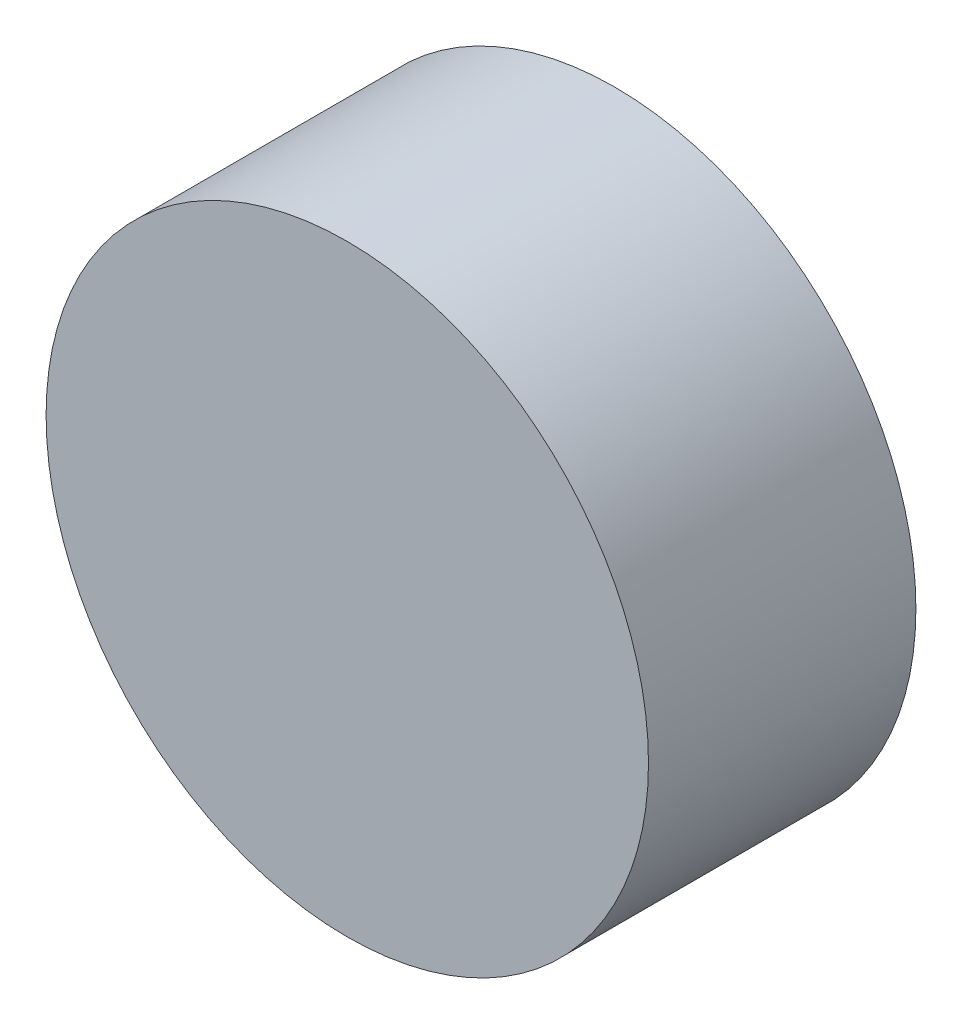
ISO-10303-21;
HEADER;
FILE_DESCRIPTION(('STEP AP214'),'2;1');
FILE_NAME('part.step','',(''),(''),'','','');
FILE_SCHEMA(('AUTOMOTIVE_DESIGN { 1 0 10303 214 1 1 1 1 }'));
ENDSEC;
DATA;
#1=APPLICATION_CONTEXT('core data for automotive mechanical design processes');
#2=APPLICATION_PROTOCOL_DEFINITION('international standard','automotive_design',2000,#1);
#3=PRODUCT_CONTEXT('',#1,'mechanical');
#4=PRODUCT('Part','Part','',(#3));
#5=PRODUCT_RELATED_PRODUCT_CATEGORY('part','',(#4));
#6=PRODUCT_DEFINITION_FORMATION('','',#4);
#7=PRODUCT_DEFINITION_CONTEXT('part definition',#1,'design');
#8=PRODUCT_DEFINITION('design','',#6,#7);
#9=PRODUCT_DEFINITION_SHAPE('','',#8);
#10=(LENGTH_UNIT() NAMED_UNIT(*) SI_UNIT(.MILLI.,.METRE.));
#11=(NAMED_UNIT(*) PLANE_ANGLE_UNIT() SI_UNIT($,.RADIAN.));
#12=(NAMED_UNIT(*) SI_UNIT($,.STERADIAN.) SOLID_ANGLE_UNIT());
#13=UNCERTAINTY_MEASURE_WITH_UNIT(LENGTH_MEASURE(1.E-05),#10,'distance_accuracy_value','');
#14=(GEOMETRIC_REPRESENTATION_CONTEXT(3) GLOBAL_UNCERTAINTY_ASSIGNED_CONTEXT((#13)) GLOBAL_UNIT_ASSIGNED_CONTEXT((#10,
#11,#12)) REPRESENTATION_CONTEXT('',''));
#15=CARTESIAN_POINT('',(0.,0.,0.));
#16=DIRECTION('',(0.,0.,1.));
#17=DIRECTION('',(1.,0.,0.));
#18=AXIS2_PLACEMENT_3D('',#15,#16,#17);
#19=CARTESIAN_POINT('',(0.,0.,11.4));
#20=DIRECTION('',(0.,0.,-1.));
#21=DIRECTION('',(-1.,0.,0.));
#22=AXIS2_PLACEMENT_3D('',#19,#20,#21);
#23=CYLINDRICAL_SURFACE('',#22,12.8396999999119);
#24=CARTESIAN_POINT('',(0.,0.,11.4));
#25=DIRECTION('',(0.,0.,1.));
#26=DIRECTION('',(1.,0.,0.));
#27=AXIS2_PLACEMENT_3D('',#24,#25,#26);
#28=CIRCLE('',#27,12.8396999999119);
#29=CARTESIAN_POINT('',(12.8396999999119,0.,11.4));
#30=VERTEX_POINT('',#29);
#31=EDGE_CURVE('E10',#30,#30,#28,.T.);
#32=ORIENTED_EDGE('',*,*,#31,.F.);
#33=EDGE_LOOP('',(#32));
#34=FACE_BOUND('',#33,.T.);
#35=CARTESIAN_POINT('',(0.,0.,0.));
#36=DIRECTION('',(0.,0.,1.));
#37=DIRECTION('',(1.,0.,0.));
#38=AXIS2_PLACEMENT_3D('',#35,#36,#37);
#39=CIRCLE('',#38,12.8396999999119);
#40=CARTESIAN_POINT('',(12.8396999999119,0.,0.));
#41=VERTEX_POINT('',#40);
#42=EDGE_CURVE('E36',#41,#41,#39,.T.);
#43=ORIENTED_EDGE('',*,*,#42,.T.);
#44=EDGE_LOOP('',(#43));
#45=FACE_BOUND('',#44,.T.);
#46=ADVANCED_FACE('F33',(#34,#45),#23,.T.);
#47=CARTESIAN_POINT('',(0.,0.,11.4));
#48=DIRECTION('',(0.,0.,1.));
#49=DIRECTION('',(1.,0.,0.));
#50=AXIS2_PLACEMENT_3D('',#47,#48,#49);
#51=PLANE('',#50);
#52=ORIENTED_EDGE('',*,*,#31,.T.);
#53=EDGE_LOOP('',(#52));
#54=FACE_BOUND('',#53,.T.);
#55=ADVANCED_FACE('F48',(#54),#51,.T.);
#56=CARTESIAN_POINT('',(0.,0.,0.));
#57=DIRECTION('',(0.,0.,1.));
#58=DIRECTION('',(1.,0.,0.));
#59=AXIS2_PLACEMENT_3D('',#56,#57,#58);
#60=PLANE('',#59);
#61=ORIENTED_EDGE('',*,*,#42,.F.);
#62=EDGE_LOOP('',(#61));
#63=FACE_BOUND('',#62,.T.);
#64=ADVANCED_FACE('F46',(#63),#60,.F.);
#65=CLOSED_SHELL('',(#46,#55,#64));
#66=MANIFOLD_SOLID_BREP('B2',#65);
#67=ADVANCED_BREP_SHAPE_REPRESENTATION('',(#18,#66),#14);
#68=SHAPE_DEFINITION_REPRESENTATION(#9,#67);
ENDSEC;
END-ISO-10303-21;
